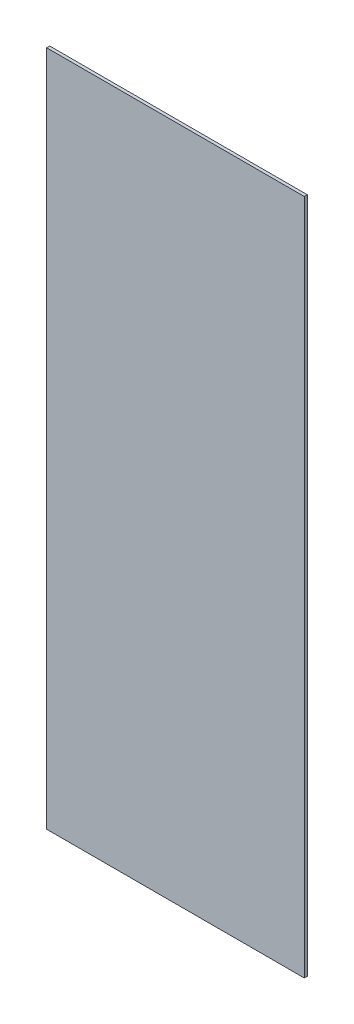
ISO-10303-21;
HEADER;
FILE_DESCRIPTION(('STEP AP214'),'2;1');
FILE_NAME('part.step','',(''),(''),'','','');
FILE_SCHEMA(('AUTOMOTIVE_DESIGN { 1 0 10303 214 1 1 1 1 }'));
ENDSEC;
DATA;
#1=APPLICATION_CONTEXT('core data for automotive mechanical design processes');
#2=APPLICATION_PROTOCOL_DEFINITION('international standard','automotive_design',2000,#1);
#3=PRODUCT_CONTEXT('',#1,'mechanical');
#4=PRODUCT('Part','Part','',(#3));
#5=PRODUCT_RELATED_PRODUCT_CATEGORY('part','',(#4));
#6=PRODUCT_DEFINITION_FORMATION('','',#4);
#7=PRODUCT_DEFINITION_CONTEXT('part definition',#1,'design');
#8=PRODUCT_DEFINITION('design','',#6,#7);
#9=PRODUCT_DEFINITION_SHAPE('','',#8);
#10=(LENGTH_UNIT() NAMED_UNIT(*) SI_UNIT(.MILLI.,.METRE.));
#11=(NAMED_UNIT(*) PLANE_ANGLE_UNIT() SI_UNIT($,.RADIAN.));
#12=(NAMED_UNIT(*) SI_UNIT($,.STERADIAN.) SOLID_ANGLE_UNIT());
#13=UNCERTAINTY_MEASURE_WITH_UNIT(LENGTH_MEASURE(1.E-05),#10,'distance_accuracy_value','');
#14=(GEOMETRIC_REPRESENTATION_CONTEXT(3) GLOBAL_UNCERTAINTY_ASSIGNED_CONTEXT((#13)) GLOBAL_UNIT_ASSIGNED_CONTEXT((#10,
#11,#12)) REPRESENTATION_CONTEXT('',''));
#15=CARTESIAN_POINT('',(0.,0.,0.));
#16=DIRECTION('',(0.,0.,1.));
#17=DIRECTION('',(1.,0.,0.));
#18=AXIS2_PLACEMENT_3D('',#15,#16,#17);
#19=CARTESIAN_POINT('',(418.175,165.85,1.5));
#20=DIRECTION('',(1.,0.,0.));
#21=DIRECTION('',(0.,1.,0.));
#22=AXIS2_PLACEMENT_3D('',#19,#20,#21);
#23=PLANE('',#22);
#24=DIRECTION('',(0.,-1.,0.));
#25=VECTOR('',#24,1.);
#26=CARTESIAN_POINT('',(418.175,165.85,0.));
#27=LINE('',#26,#25);
#28=CARTESIAN_POINT('',(418.175,165.85,0.));
#29=VERTEX_POINT('',#28);
#30=CARTESIAN_POINT('',(418.175,-165.85,0.));
#31=VERTEX_POINT('',#30);
#32=EDGE_CURVE('E107',#29,#31,#27,.T.);
#33=ORIENTED_EDGE('',*,*,#32,.T.);
#34=DIRECTION('',(0.,0.,-1.));
#35=VECTOR('',#34,1.);
#36=CARTESIAN_POINT('',(418.175,-165.85,1.5));
#37=LINE('',#36,#35);
#38=CARTESIAN_POINT('',(418.175,-165.85,1.5));
#39=VERTEX_POINT('',#38);
#40=EDGE_CURVE('E11',#39,#31,#37,.T.);
#41=ORIENTED_EDGE('',*,*,#40,.F.);
#42=DIRECTION('',(0.,-1.,0.));
#43=VECTOR('',#42,1.);
#44=CARTESIAN_POINT('',(418.175,165.85,1.5));
#45=LINE('',#44,#43);
#46=CARTESIAN_POINT('',(418.175,165.85,1.5));
#47=VERTEX_POINT('',#46);
#48=EDGE_CURVE('E91',#47,#39,#45,.T.);
#49=ORIENTED_EDGE('',*,*,#48,.F.);
#50=DIRECTION('',(0.,0.,-1.));
#51=VECTOR('',#50,1.);
#52=CARTESIAN_POINT('',(418.175,165.85,1.5));
#53=LINE('',#52,#51);
#54=EDGE_CURVE('E103',#47,#29,#53,.T.);
#55=ORIENTED_EDGE('',*,*,#54,.T.);
#56=EDGE_LOOP('',(#33,#41,#49,#55));
#57=FACE_BOUND('',#56,.T.);
#58=ADVANCED_FACE('F36',(#57),#23,.F.);
#59=CARTESIAN_POINT('',(418.175,-165.85,1.5));
#60=DIRECTION('',(0.,1.,0.));
#61=DIRECTION('',(0.,0.,1.));
#62=AXIS2_PLACEMENT_3D('',#59,#60,#61);
#63=PLANE('',#62);
#64=DIRECTION('',(1.,0.,0.));
#65=VECTOR('',#64,1.);
#66=CARTESIAN_POINT('',(418.175,-165.85,0.));
#67=LINE('',#66,#65);
#68=CARTESIAN_POINT('',(544.425,-165.85,0.));
#69=VERTEX_POINT('',#68);
#70=EDGE_CURVE('E95',#31,#69,#67,.T.);
#71=ORIENTED_EDGE('',*,*,#70,.T.);
#72=DIRECTION('',(0.,0.,-1.));
#73=VECTOR('',#72,1.);
#74=CARTESIAN_POINT('',(544.425,-165.85,1.5));
#75=LINE('',#74,#73);
#76=CARTESIAN_POINT('',(544.425,-165.85,1.5));
#77=VERTEX_POINT('',#76);
#78=EDGE_CURVE('E44',#77,#69,#75,.T.);
#79=ORIENTED_EDGE('',*,*,#78,.F.);
#80=DIRECTION('',(1.,0.,0.));
#81=VECTOR('',#80,1.);
#82=CARTESIAN_POINT('',(418.175,-165.85,1.5));
#83=LINE('',#82,#81);
#84=EDGE_CURVE('E86',#39,#77,#83,.T.);
#85=ORIENTED_EDGE('',*,*,#84,.F.);
#86=ORIENTED_EDGE('',*,*,#40,.T.);
#87=EDGE_LOOP('',(#71,#79,#85,#86));
#88=FACE_BOUND('',#87,.T.);
#89=ADVANCED_FACE('F94',(#88),#63,.F.);
#90=CARTESIAN_POINT('',(544.425,165.85,1.5));
#91=DIRECTION('',(-1.,0.,0.));
#92=DIRECTION('',(0.,0.,1.));
#93=AXIS2_PLACEMENT_3D('',#90,#91,#92);
#94=PLANE('',#93);
#95=DIRECTION('',(0.,1.,0.));
#96=VECTOR('',#95,1.);
#97=CARTESIAN_POINT('',(544.425,165.85,0.));
#98=LINE('',#97,#96);
#99=CARTESIAN_POINT('',(544.425,165.85,0.));
#100=VERTEX_POINT('',#99);
#101=EDGE_CURVE('E73',#69,#100,#98,.T.);
#102=ORIENTED_EDGE('',*,*,#101,.T.);
#103=DIRECTION('',(0.,0.,-1.));
#104=VECTOR('',#103,1.);
#105=CARTESIAN_POINT('',(544.425,165.85,1.5));
#106=LINE('',#105,#104);
#107=CARTESIAN_POINT('',(544.425,165.85,1.5));
#108=VERTEX_POINT('',#107);
#109=EDGE_CURVE('E96',#108,#100,#106,.T.);
#110=ORIENTED_EDGE('',*,*,#109,.F.);
#111=DIRECTION('',(0.,1.,0.));
#112=VECTOR('',#111,1.);
#113=CARTESIAN_POINT('',(544.425,165.85,1.5));
#114=LINE('',#113,#112);
#115=EDGE_CURVE('E89',#77,#108,#114,.T.);
#116=ORIENTED_EDGE('',*,*,#115,.F.);
#117=ORIENTED_EDGE('',*,*,#78,.T.);
#118=EDGE_LOOP('',(#102,#110,#116,#117));
#119=FACE_BOUND('',#118,.T.);
#120=ADVANCED_FACE('F97',(#119),#94,.F.);
#121=CARTESIAN_POINT('',(418.175,165.85,1.5));
#122=DIRECTION('',(0.,-1.,0.));
#123=DIRECTION('',(0.,0.,-1.));
#124=AXIS2_PLACEMENT_3D('',#121,#122,#123);
#125=PLANE('',#124);
#126=DIRECTION('',(-1.,0.,0.));
#127=VECTOR('',#126,1.);
#128=CARTESIAN_POINT('',(418.175,165.85,0.));
#129=LINE('',#128,#127);
#130=EDGE_CURVE('E79',#100,#29,#129,.T.);
#131=ORIENTED_EDGE('',*,*,#130,.T.);
#132=ORIENTED_EDGE('',*,*,#54,.F.);
#133=DIRECTION('',(-1.,0.,0.));
#134=VECTOR('',#133,1.);
#135=CARTESIAN_POINT('',(418.175,165.85,1.5));
#136=LINE('',#135,#134);
#137=EDGE_CURVE('E55',#108,#47,#136,.T.);
#138=ORIENTED_EDGE('',*,*,#137,.F.);
#139=ORIENTED_EDGE('',*,*,#109,.T.);
#140=EDGE_LOOP('',(#131,#132,#138,#139));
#141=FACE_BOUND('',#140,.T.);
#142=ADVANCED_FACE('F117',(#141),#125,.F.);
#143=CARTESIAN_POINT('',(418.175,-165.85,1.5));
#144=DIRECTION('',(0.,0.,1.));
#145=DIRECTION('',(1.,0.,0.));
#146=AXIS2_PLACEMENT_3D('',#143,#144,#145);
#147=PLANE('',#146);
#148=ORIENTED_EDGE('',*,*,#48,.T.);
#149=ORIENTED_EDGE('',*,*,#84,.T.);
#150=ORIENTED_EDGE('',*,*,#115,.T.);
#151=ORIENTED_EDGE('',*,*,#137,.T.);
#152=EDGE_LOOP('',(#148,#149,#150,#151));
#153=FACE_BOUND('',#152,.T.);
#154=ADVANCED_FACE('F87',(#153),#147,.T.);
#155=CARTESIAN_POINT('',(418.175,-165.85,0.));
#156=DIRECTION('',(0.,0.,1.));
#157=DIRECTION('',(1.,0.,0.));
#158=AXIS2_PLACEMENT_3D('',#155,#156,#157);
#159=PLANE('',#158);
#160=ORIENTED_EDGE('',*,*,#32,.F.);
#161=ORIENTED_EDGE('',*,*,#130,.F.);
#162=ORIENTED_EDGE('',*,*,#101,.F.);
#163=ORIENTED_EDGE('',*,*,#70,.F.);
#164=EDGE_LOOP('',(#160,#161,#162,#163));
#165=FACE_BOUND('',#164,.T.);
#166=ADVANCED_FACE('F120',(#165),#159,.F.);
#167=CLOSED_SHELL('',(#58,#89,#120,#142,#154,#166));
#168=MANIFOLD_SOLID_BREP('B2',#167);
#169=ADVANCED_BREP_SHAPE_REPRESENTATION('',(#18,#168),#14);
#170=SHAPE_DEFINITION_REPRESENTATION(#9,#169);
ENDSEC;
END-ISO-10303-21;
